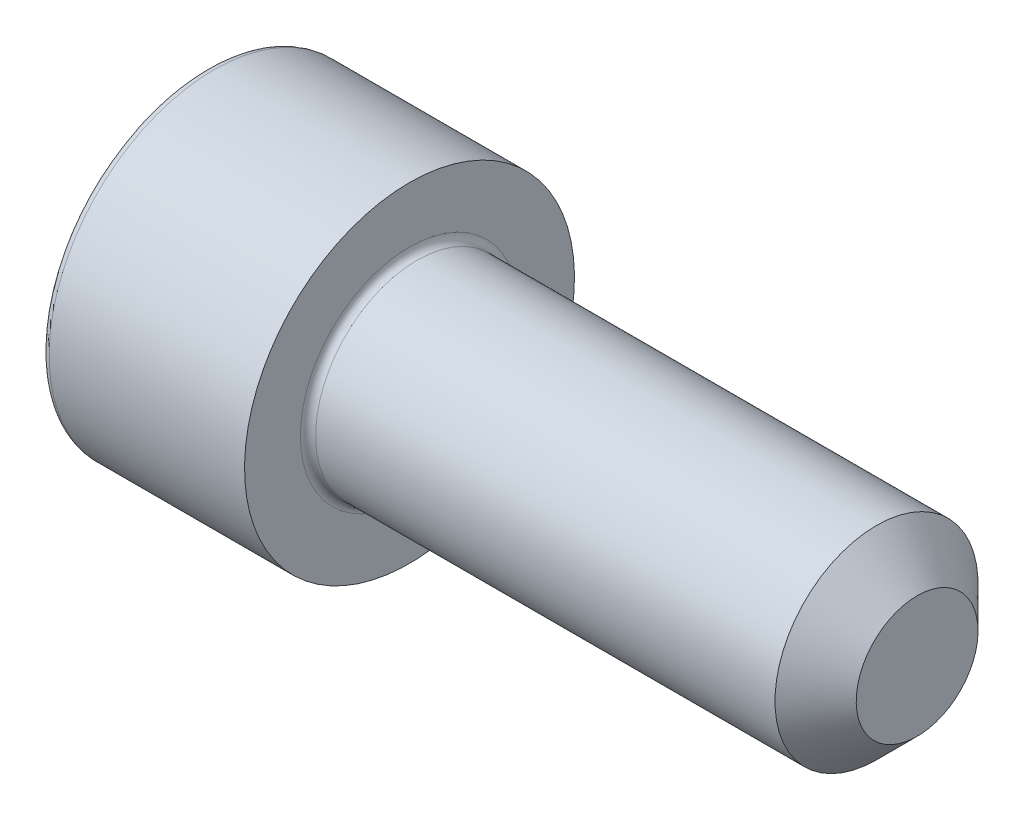
ISO-10303-21;
HEADER;
FILE_DESCRIPTION(('STEP AP214'),'2;1');
FILE_NAME('part.step','',(''),(''),'','','');
FILE_SCHEMA(('AUTOMOTIVE_DESIGN { 1 0 10303 214 1 1 1 1 }'));
ENDSEC;
DATA;
#1=APPLICATION_CONTEXT('core data for automotive mechanical design processes');
#2=APPLICATION_PROTOCOL_DEFINITION('international standard','automotive_design',2000,#1);
#3=PRODUCT_CONTEXT('',#1,'mechanical');
#4=PRODUCT('Part','Part','',(#3));
#5=PRODUCT_RELATED_PRODUCT_CATEGORY('part','',(#4));
#6=PRODUCT_DEFINITION_FORMATION('','',#4);
#7=PRODUCT_DEFINITION_CONTEXT('part definition',#1,'design');
#8=PRODUCT_DEFINITION('design','',#6,#7);
#9=PRODUCT_DEFINITION_SHAPE('','',#8);
#10=(LENGTH_UNIT() NAMED_UNIT(*) SI_UNIT(.MILLI.,.METRE.));
#11=(NAMED_UNIT(*) PLANE_ANGLE_UNIT() SI_UNIT($,.RADIAN.));
#12=(NAMED_UNIT(*) SI_UNIT($,.STERADIAN.) SOLID_ANGLE_UNIT());
#13=UNCERTAINTY_MEASURE_WITH_UNIT(LENGTH_MEASURE(1.E-05),#10,'distance_accuracy_value','');
#14=(GEOMETRIC_REPRESENTATION_CONTEXT(3) GLOBAL_UNCERTAINTY_ASSIGNED_CONTEXT((#13)) GLOBAL_UNIT_ASSIGNED_CONTEXT((#10,
#11,#12)) REPRESENTATION_CONTEXT('',''));
#15=CARTESIAN_POINT('',(0.,0.,0.));
#16=DIRECTION('',(0.,0.,1.));
#17=DIRECTION('',(1.,0.,0.));
#18=AXIS2_PLACEMENT_3D('',#15,#16,#17);
#19=CARTESIAN_POINT('',(0.,0.,0.));
#20=DIRECTION('',(-1.,0.,0.));
#21=DIRECTION('',(0.,-1.,0.));
#22=AXIS2_PLACEMENT_3D('',#19,#20,#21);
#23=PLANE('',#22);
#24=CARTESIAN_POINT('',(0.,0.,0.));
#25=DIRECTION('',(-1.,0.,0.));
#26=DIRECTION('',(0.,-1.,0.));
#27=AXIS2_PLACEMENT_3D('',#24,#25,#26);
#28=CIRCLE('',#27,6.2);
#29=CARTESIAN_POINT('',(0.,-6.2,0.));
#30=VERTEX_POINT('',#29);
#31=EDGE_CURVE('E158',#30,#30,#28,.T.);
#32=ORIENTED_EDGE('',*,*,#31,.T.);
#33=EDGE_LOOP('',(#32));
#34=FACE_BOUND('',#33,.T.);
#35=DIRECTION('',(0.,0.,-1.));
#36=VECTOR('',#35,1.);
#37=CARTESIAN_POINT('',(0.,3.,1.73205080756888));
#38=LINE('',#37,#36);
#39=CARTESIAN_POINT('',(0.,3.,1.73205080756888));
#40=VERTEX_POINT('',#39);
#41=CARTESIAN_POINT('',(0.,3.,-1.73205080756888));
#42=VERTEX_POINT('',#41);
#43=EDGE_CURVE('E54',#40,#42,#38,.T.);
#44=ORIENTED_EDGE('',*,*,#43,.F.);
#45=DIRECTION('',(0.,0.866025403784439,-0.5));
#46=VECTOR('',#45,1.);
#47=CARTESIAN_POINT('',(0.,0.,3.46410161513775));
#48=LINE('',#47,#46);
#49=CARTESIAN_POINT('',(0.,0.,3.46410161513775));
#50=VERTEX_POINT('',#49);
#51=EDGE_CURVE('E137',#50,#40,#48,.T.);
#52=ORIENTED_EDGE('',*,*,#51,.F.);
#53=DIRECTION('',(0.,0.866025403784439,0.5));
#54=VECTOR('',#53,1.);
#55=CARTESIAN_POINT('',(0.,-3.,1.73205080756888));
#56=LINE('',#55,#54);
#57=CARTESIAN_POINT('',(0.,-3.,1.73205080756888));
#58=VERTEX_POINT('',#57);
#59=EDGE_CURVE('E135',#58,#50,#56,.T.);
#60=ORIENTED_EDGE('',*,*,#59,.F.);
#61=DIRECTION('',(0.,0.,1.));
#62=VECTOR('',#61,1.);
#63=CARTESIAN_POINT('',(0.,-3.,-1.73205080756888));
#64=LINE('',#63,#62);
#65=CARTESIAN_POINT('',(0.,-3.,-1.73205080756888));
#66=VERTEX_POINT('',#65);
#67=EDGE_CURVE('E102',#66,#58,#64,.T.);
#68=ORIENTED_EDGE('',*,*,#67,.F.);
#69=DIRECTION('',(0.,-0.866025403784439,0.5));
#70=VECTOR('',#69,1.);
#71=CARTESIAN_POINT('',(0.,0.,-3.46410161513775));
#72=LINE('',#71,#70);
#73=CARTESIAN_POINT('',(0.,0.,-3.46410161513775));
#74=VERTEX_POINT('',#73);
#75=EDGE_CURVE('E131',#74,#66,#72,.T.);
#76=ORIENTED_EDGE('',*,*,#75,.F.);
#77=DIRECTION('',(0.,-0.866025403784438,-0.5));
#78=VECTOR('',#77,1.);
#79=CARTESIAN_POINT('',(0.,3.,-1.73205080756888));
#80=LINE('',#79,#78);
#81=EDGE_CURVE('E128',#42,#74,#80,.T.);
#82=ORIENTED_EDGE('',*,*,#81,.F.);
#83=EDGE_LOOP('',(#44,#52,#60,#68,#76,#82));
#84=FACE_BOUND('',#83,.T.);
#85=ADVANCED_FACE('F38',(#34,#84),#23,.T.);
#86=CARTESIAN_POINT('',(28.,0.,0.));
#87=DIRECTION('',(1.,0.,0.));
#88=DIRECTION('',(0.,1.,0.));
#89=AXIS2_PLACEMENT_3D('',#86,#87,#88);
#90=CYLINDRICAL_SURFACE('',#89,6.5);
#91=CARTESIAN_POINT('',(0.300000000000002,0.,0.));
#92=DIRECTION('',(-1.,0.,0.));
#93=DIRECTION('',(0.,-1.,0.));
#94=AXIS2_PLACEMENT_3D('',#91,#92,#93);
#95=CIRCLE('',#94,6.5);
#96=CARTESIAN_POINT('',(0.300000000000003,-6.5,0.));
#97=VERTEX_POINT('',#96);
#98=EDGE_CURVE('E155',#97,#97,#95,.F.);
#99=ORIENTED_EDGE('',*,*,#98,.T.);
#100=EDGE_LOOP('',(#99));
#101=FACE_BOUND('',#100,.T.);
#102=CARTESIAN_POINT('',(8.,0.,0.));
#103=DIRECTION('',(1.,0.,0.));
#104=DIRECTION('',(0.,1.,0.));
#105=AXIS2_PLACEMENT_3D('',#102,#103,#104);
#106=CIRCLE('',#105,6.49999999999999);
#107=CARTESIAN_POINT('',(8.,6.49999999999999,0.));
#108=VERTEX_POINT('',#107);
#109=EDGE_CURVE('E141',#108,#108,#106,.T.);
#110=ORIENTED_EDGE('',*,*,#109,.F.);
#111=EDGE_LOOP('',(#110));
#112=FACE_BOUND('',#111,.T.);
#113=ADVANCED_FACE('F175',(#101,#112),#90,.T.);
#114=CARTESIAN_POINT('',(8.,6.5,0.));
#115=DIRECTION('',(1.,0.,0.));
#116=DIRECTION('',(0.,1.,0.));
#117=AXIS2_PLACEMENT_3D('',#114,#115,#116);
#118=PLANE('',#117);
#119=CARTESIAN_POINT('',(8.,0.,0.));
#120=DIRECTION('',(1.,0.,0.));
#121=DIRECTION('',(0.,1.,0.));
#122=AXIS2_PLACEMENT_3D('',#119,#120,#121);
#123=CIRCLE('',#122,4.29999999999999);
#124=CARTESIAN_POINT('',(8.,4.3,0.));
#125=VERTEX_POINT('',#124);
#126=EDGE_CURVE('E152',#125,#125,#123,.F.);
#127=ORIENTED_EDGE('',*,*,#126,.T.);
#128=EDGE_LOOP('',(#127));
#129=FACE_BOUND('',#128,.T.);
#130=ORIENTED_EDGE('',*,*,#109,.T.);
#131=EDGE_LOOP('',(#130));
#132=FACE_BOUND('',#131,.T.);
#133=ADVANCED_FACE('F181',(#129,#132),#118,.T.);
#134=CARTESIAN_POINT('',(28.,0.,0.));
#135=DIRECTION('',(1.,0.,0.));
#136=DIRECTION('',(0.,1.,0.));
#137=AXIS2_PLACEMENT_3D('',#134,#135,#136);
#138=CYLINDRICAL_SURFACE('',#137,3.99999999999999);
#139=CARTESIAN_POINT('',(26.4,0.,0.));
#140=DIRECTION('',(1.,0.,0.));
#141=DIRECTION('',(0.,1.,0.));
#142=AXIS2_PLACEMENT_3D('',#139,#140,#141);
#143=CIRCLE('',#142,3.99999999999999);
#144=CARTESIAN_POINT('',(26.4,4.,0.));
#145=VERTEX_POINT('',#144);
#146=EDGE_CURVE('E11',#145,#145,#143,.F.);
#147=ORIENTED_EDGE('',*,*,#146,.T.);
#148=EDGE_LOOP('',(#147));
#149=FACE_BOUND('',#148,.T.);
#150=CARTESIAN_POINT('',(8.3,0.,0.));
#151=DIRECTION('',(1.,0.,0.));
#152=DIRECTION('',(0.,1.,0.));
#153=AXIS2_PLACEMENT_3D('',#150,#151,#152);
#154=CIRCLE('',#153,3.99999999999999);
#155=CARTESIAN_POINT('',(8.3,4.,0.));
#156=VERTEX_POINT('',#155);
#157=EDGE_CURVE('E149',#156,#156,#154,.T.);
#158=ORIENTED_EDGE('',*,*,#157,.T.);
#159=EDGE_LOOP('',(#158));
#160=FACE_BOUND('',#159,.T.);
#161=ADVANCED_FACE('F198',(#149,#160),#138,.T.);
#162=CARTESIAN_POINT('',(28.,4.,0.));
#163=DIRECTION('',(1.,0.,0.));
#164=DIRECTION('',(0.,1.,0.));
#165=AXIS2_PLACEMENT_3D('',#162,#163,#164);
#166=PLANE('',#165);
#167=CARTESIAN_POINT('',(28.,0.,0.));
#168=DIRECTION('',(1.,0.,0.));
#169=DIRECTION('',(0.,1.,0.));
#170=AXIS2_PLACEMENT_3D('',#167,#168,#169);
#171=CIRCLE('',#170,2.39999999999999);
#172=CARTESIAN_POINT('',(28.,2.39999999999999,0.));
#173=VERTEX_POINT('',#172);
#174=EDGE_CURVE('E47',#173,#173,#171,.T.);
#175=ORIENTED_EDGE('',*,*,#174,.T.);
#176=EDGE_LOOP('',(#175));
#177=FACE_BOUND('',#176,.T.);
#178=ADVANCED_FACE('F163',(#177),#166,.T.);
#179=CARTESIAN_POINT('',(2.5,3.,1.73205080756888));
#180=DIRECTION('',(0.,1.,0.));
#181=DIRECTION('',(-1.,0.,0.));
#182=AXIS2_PLACEMENT_3D('',#179,#180,#181);
#183=PLANE('',#182);
#184=ORIENTED_EDGE('',*,*,#43,.T.);
#185=DIRECTION('',(-1.,0.,0.));
#186=VECTOR('',#185,1.);
#187=CARTESIAN_POINT('',(2.5,3.,-1.73205080756888));
#188=LINE('',#187,#186);
#189=CARTESIAN_POINT('',(2.5,3.,-1.73205080756888));
#190=VERTEX_POINT('',#189);
#191=EDGE_CURVE('E84',#190,#42,#188,.T.);
#192=ORIENTED_EDGE('',*,*,#191,.F.);
#193=DIRECTION('',(0.,0.,-1.));
#194=VECTOR('',#193,1.);
#195=CARTESIAN_POINT('',(2.5,3.,1.73205080756888));
#196=LINE('',#195,#194);
#197=CARTESIAN_POINT('',(2.5,3.,1.73205080756888));
#198=VERTEX_POINT('',#197);
#199=EDGE_CURVE('E139',#198,#190,#196,.T.);
#200=ORIENTED_EDGE('',*,*,#199,.F.);
#201=DIRECTION('',(-1.,0.,0.));
#202=VECTOR('',#201,1.);
#203=CARTESIAN_POINT('',(2.5,3.,1.73205080756888));
#204=LINE('',#203,#202);
#205=EDGE_CURVE('E62',#198,#40,#204,.T.);
#206=ORIENTED_EDGE('',*,*,#205,.T.);
#207=EDGE_LOOP('',(#184,#192,#200,#206));
#208=FACE_BOUND('',#207,.T.);
#209=ADVANCED_FACE('F206',(#208),#183,.F.);
#210=CARTESIAN_POINT('',(2.5,0.,3.46410161513775));
#211=DIRECTION('',(0.,0.5,0.866025403784439));
#212=DIRECTION('',(0.,-0.866025403784439,0.5));
#213=AXIS2_PLACEMENT_3D('',#210,#211,#212);
#214=PLANE('',#213);
#215=ORIENTED_EDGE('',*,*,#51,.T.);
#216=ORIENTED_EDGE('',*,*,#205,.F.);
#217=DIRECTION('',(0.,0.866025403784439,-0.5));
#218=VECTOR('',#217,1.);
#219=CARTESIAN_POINT('',(2.5,0.,3.46410161513775));
#220=LINE('',#219,#218);
#221=CARTESIAN_POINT('',(2.5,0.,3.46410161513775));
#222=VERTEX_POINT('',#221);
#223=EDGE_CURVE('E114',#222,#198,#220,.T.);
#224=ORIENTED_EDGE('',*,*,#223,.F.);
#225=DIRECTION('',(-1.,0.,0.));
#226=VECTOR('',#225,1.);
#227=CARTESIAN_POINT('',(2.5,0.,3.46410161513775));
#228=LINE('',#227,#226);
#229=EDGE_CURVE('E106',#222,#50,#228,.T.);
#230=ORIENTED_EDGE('',*,*,#229,.T.);
#231=EDGE_LOOP('',(#215,#216,#224,#230));
#232=FACE_BOUND('',#231,.T.);
#233=ADVANCED_FACE('F212',(#232),#214,.F.);
#234=CARTESIAN_POINT('',(2.5,-3.,1.73205080756888));
#235=DIRECTION('',(0.,-0.5,0.866025403784439));
#236=DIRECTION('',(0.,-0.866025403784439,-0.5));
#237=AXIS2_PLACEMENT_3D('',#234,#235,#236);
#238=PLANE('',#237);
#239=ORIENTED_EDGE('',*,*,#59,.T.);
#240=ORIENTED_EDGE('',*,*,#229,.F.);
#241=DIRECTION('',(0.,0.866025403784439,0.5));
#242=VECTOR('',#241,1.);
#243=CARTESIAN_POINT('',(2.5,-3.,1.73205080756888));
#244=LINE('',#243,#242);
#245=CARTESIAN_POINT('',(2.5,-3.,1.73205080756888));
#246=VERTEX_POINT('',#245);
#247=EDGE_CURVE('E110',#246,#222,#244,.T.);
#248=ORIENTED_EDGE('',*,*,#247,.F.);
#249=DIRECTION('',(-1.,0.,0.));
#250=VECTOR('',#249,1.);
#251=CARTESIAN_POINT('',(2.5,-3.,1.73205080756888));
#252=LINE('',#251,#250);
#253=EDGE_CURVE('E95',#246,#58,#252,.T.);
#254=ORIENTED_EDGE('',*,*,#253,.T.);
#255=EDGE_LOOP('',(#239,#240,#248,#254));
#256=FACE_BOUND('',#255,.T.);
#257=ADVANCED_FACE('F111',(#256),#238,.F.);
#258=CARTESIAN_POINT('',(2.5,-3.,-1.73205080756888));
#259=DIRECTION('',(0.,-1.,0.));
#260=DIRECTION('',(0.,0.,-1.));
#261=AXIS2_PLACEMENT_3D('',#258,#259,#260);
#262=PLANE('',#261);
#263=ORIENTED_EDGE('',*,*,#67,.T.);
#264=ORIENTED_EDGE('',*,*,#253,.F.);
#265=DIRECTION('',(0.,0.,1.));
#266=VECTOR('',#265,1.);
#267=CARTESIAN_POINT('',(2.5,-3.,-1.73205080756888));
#268=LINE('',#267,#266);
#269=CARTESIAN_POINT('',(2.5,-3.,-1.73205080756888));
#270=VERTEX_POINT('',#269);
#271=EDGE_CURVE('E99',#270,#246,#268,.T.);
#272=ORIENTED_EDGE('',*,*,#271,.F.);
#273=DIRECTION('',(-1.,0.,0.));
#274=VECTOR('',#273,1.);
#275=CARTESIAN_POINT('',(2.5,-3.,-1.73205080756888));
#276=LINE('',#275,#274);
#277=EDGE_CURVE('E107',#270,#66,#276,.T.);
#278=ORIENTED_EDGE('',*,*,#277,.T.);
#279=EDGE_LOOP('',(#263,#264,#272,#278));
#280=FACE_BOUND('',#279,.T.);
#281=ADVANCED_FACE('F97',(#280),#262,.F.);
#282=CARTESIAN_POINT('',(2.5,0.,-3.46410161513775));
#283=DIRECTION('',(0.,-0.5,-0.866025403784439));
#284=DIRECTION('',(0.,0.866025403784439,-0.5));
#285=AXIS2_PLACEMENT_3D('',#282,#283,#284);
#286=PLANE('',#285);
#287=ORIENTED_EDGE('',*,*,#75,.T.);
#288=ORIENTED_EDGE('',*,*,#277,.F.);
#289=DIRECTION('',(0.,-0.866025403784439,0.5));
#290=VECTOR('',#289,1.);
#291=CARTESIAN_POINT('',(2.5,0.,-3.46410161513775));
#292=LINE('',#291,#290);
#293=CARTESIAN_POINT('',(2.5,0.,-3.46410161513775));
#294=VERTEX_POINT('',#293);
#295=EDGE_CURVE('E120',#294,#270,#292,.T.);
#296=ORIENTED_EDGE('',*,*,#295,.F.);
#297=DIRECTION('',(-1.,0.,0.));
#298=VECTOR('',#297,1.);
#299=CARTESIAN_POINT('',(2.5,0.,-3.46410161513775));
#300=LINE('',#299,#298);
#301=EDGE_CURVE('E144',#294,#74,#300,.T.);
#302=ORIENTED_EDGE('',*,*,#301,.T.);
#303=EDGE_LOOP('',(#287,#288,#296,#302));
#304=FACE_BOUND('',#303,.T.);
#305=ADVANCED_FACE('F215',(#304),#286,.F.);
#306=CARTESIAN_POINT('',(2.5,3.,-1.73205080756888));
#307=DIRECTION('',(0.,0.5,-0.866025403784439));
#308=DIRECTION('',(0.,0.866025403784439,0.5));
#309=AXIS2_PLACEMENT_3D('',#306,#307,#308);
#310=PLANE('',#309);
#311=ORIENTED_EDGE('',*,*,#81,.T.);
#312=ORIENTED_EDGE('',*,*,#301,.F.);
#313=DIRECTION('',(0.,-0.866025403784438,-0.5));
#314=VECTOR('',#313,1.);
#315=CARTESIAN_POINT('',(2.5,3.,-1.73205080756888));
#316=LINE('',#315,#314);
#317=EDGE_CURVE('E122',#190,#294,#316,.T.);
#318=ORIENTED_EDGE('',*,*,#317,.F.);
#319=ORIENTED_EDGE('',*,*,#191,.T.);
#320=EDGE_LOOP('',(#311,#312,#318,#319));
#321=FACE_BOUND('',#320,.T.);
#322=ADVANCED_FACE('F192',(#321),#310,.F.);
#323=CARTESIAN_POINT('',(2.5,0.,0.));
#324=DIRECTION('',(-1.,0.,0.));
#325=DIRECTION('',(0.,-1.,0.));
#326=AXIS2_PLACEMENT_3D('',#323,#324,#325);
#327=PLANE('',#326);
#328=ORIENTED_EDGE('',*,*,#199,.T.);
#329=ORIENTED_EDGE('',*,*,#317,.T.);
#330=ORIENTED_EDGE('',*,*,#295,.T.);
#331=ORIENTED_EDGE('',*,*,#271,.T.);
#332=ORIENTED_EDGE('',*,*,#247,.T.);
#333=ORIENTED_EDGE('',*,*,#223,.T.);
#334=EDGE_LOOP('',(#328,#329,#330,#331,#332,#333));
#335=FACE_BOUND('',#334,.T.);
#336=ADVANCED_FACE('F117',(#335),#327,.T.);
#337=CARTESIAN_POINT('',(8.3,0.,0.));
#338=DIRECTION('',(1.,0.,0.));
#339=DIRECTION('',(0.,1.,0.));
#340=AXIS2_PLACEMENT_3D('',#337,#338,#339);
#341=TOROIDAL_SURFACE('',#340,4.29999999999999,0.3);
#342=ORIENTED_EDGE('',*,*,#126,.F.);
#343=EDGE_LOOP('',(#342));
#344=FACE_BOUND('',#343,.T.);
#345=ORIENTED_EDGE('',*,*,#157,.F.);
#346=EDGE_LOOP('',(#345));
#347=FACE_BOUND('',#346,.T.);
#348=ADVANCED_FACE('F171',(#344,#347),#341,.F.);
#349=CARTESIAN_POINT('',(0.300000000000002,0.,0.));
#350=DIRECTION('',(-1.,0.,0.));
#351=DIRECTION('',(0.,-1.,0.));
#352=AXIS2_PLACEMENT_3D('',#349,#350,#351);
#353=TOROIDAL_SURFACE('',#352,6.2,0.3);
#354=ORIENTED_EDGE('',*,*,#31,.F.);
#355=EDGE_LOOP('',(#354));
#356=FACE_BOUND('',#355,.T.);
#357=ORIENTED_EDGE('',*,*,#98,.F.);
#358=EDGE_LOOP('',(#357));
#359=FACE_BOUND('',#358,.T.);
#360=ADVANCED_FACE('F166',(#356,#359),#353,.T.);
#361=CARTESIAN_POINT('',(28.,0.,0.));
#362=DIRECTION('',(-1.,0.,0.));
#363=DIRECTION('',(0.,-1.,0.));
#364=AXIS2_PLACEMENT_3D('',#361,#362,#363);
#365=CONICAL_SURFACE('',#364,2.39999999999999,0.785398163397446);
#366=ORIENTED_EDGE('',*,*,#146,.F.);
#367=EDGE_LOOP('',(#366));
#368=FACE_BOUND('',#367,.T.);
#369=ORIENTED_EDGE('',*,*,#174,.F.);
#370=EDGE_LOOP('',(#369));
#371=FACE_BOUND('',#370,.T.);
#372=ADVANCED_FACE('F41',(#368,#371),#365,.T.);
#373=CLOSED_SHELL('',(#85,#113,#133,#161,#178,#209,#233,#257,#281,#305,#322,#336,#348,#360,#372));
#374=MANIFOLD_SOLID_BREP('B2',#373);
#375=ADVANCED_BREP_SHAPE_REPRESENTATION('',(#18,#374),#14);
#376=SHAPE_DEFINITION_REPRESENTATION(#9,#375);
ENDSEC;
END-ISO-10303-21;
